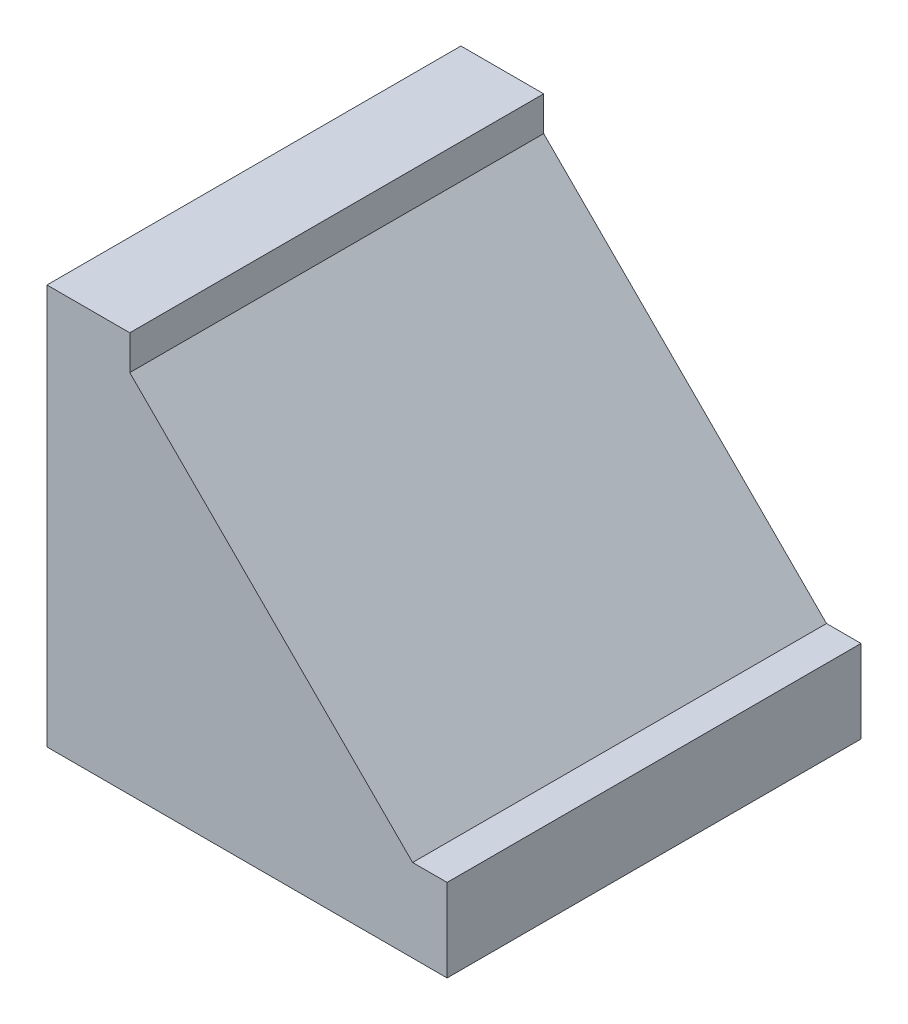
ISO-10303-21;
HEADER;
FILE_DESCRIPTION(('STEP AP214'),'2;1');
FILE_NAME('part.step','',(''),(''),'','','');
FILE_SCHEMA(('AUTOMOTIVE_DESIGN { 1 0 10303 214 1 1 1 1 }'));
ENDSEC;
DATA;
#1=APPLICATION_CONTEXT('core data for automotive mechanical design processes');
#2=APPLICATION_PROTOCOL_DEFINITION('international standard','automotive_design',2000,#1);
#3=PRODUCT_CONTEXT('',#1,'mechanical');
#4=PRODUCT('Part','Part','',(#3));
#5=PRODUCT_RELATED_PRODUCT_CATEGORY('part','',(#4));
#6=PRODUCT_DEFINITION_FORMATION('','',#4);
#7=PRODUCT_DEFINITION_CONTEXT('part definition',#1,'design');
#8=PRODUCT_DEFINITION('design','',#6,#7);
#9=PRODUCT_DEFINITION_SHAPE('','',#8);
#10=(LENGTH_UNIT() NAMED_UNIT(*) SI_UNIT(.MILLI.,.METRE.));
#11=(NAMED_UNIT(*) PLANE_ANGLE_UNIT() SI_UNIT($,.RADIAN.));
#12=(NAMED_UNIT(*) SI_UNIT($,.STERADIAN.) SOLID_ANGLE_UNIT());
#13=UNCERTAINTY_MEASURE_WITH_UNIT(LENGTH_MEASURE(1.E-05),#10,'distance_accuracy_value','');
#14=(GEOMETRIC_REPRESENTATION_CONTEXT(3) GLOBAL_UNCERTAINTY_ASSIGNED_CONTEXT((#13)) GLOBAL_UNIT_ASSIGNED_CONTEXT((#10,
#11,#12)) REPRESENTATION_CONTEXT('',''));
#15=CARTESIAN_POINT('',(0.,0.,0.));
#16=DIRECTION('',(0.,0.,1.));
#17=DIRECTION('',(1.,0.,0.));
#18=AXIS2_PLACEMENT_3D('',#15,#16,#17);
#19=CARTESIAN_POINT('',(12.,58.,60.));
#20=DIRECTION('',(0.,-1.,0.));
#21=DIRECTION('',(1.,0.,0.));
#22=AXIS2_PLACEMENT_3D('',#19,#20,#21);
#23=PLANE('',#22);
#24=DIRECTION('',(-1.,0.,0.));
#25=VECTOR('',#24,1.);
#26=CARTESIAN_POINT('',(12.,58.,0.));
#27=LINE('',#26,#25);
#28=CARTESIAN_POINT('',(12.,58.,0.));
#29=VERTEX_POINT('',#28);
#30=CARTESIAN_POINT('',(0.,58.,0.));
#31=VERTEX_POINT('',#30);
#32=EDGE_CURVE('E126',#29,#31,#27,.T.);
#33=ORIENTED_EDGE('',*,*,#32,.T.);
#34=DIRECTION('',(0.,0.,-1.));
#35=VECTOR('',#34,1.);
#36=CARTESIAN_POINT('',(0.,58.,60.));
#37=LINE('',#36,#35);
#38=CARTESIAN_POINT('',(0.,58.,60.));
#39=VERTEX_POINT('',#38);
#40=EDGE_CURVE('E11',#39,#31,#37,.T.);
#41=ORIENTED_EDGE('',*,*,#40,.F.);
#42=DIRECTION('',(-1.,0.,0.));
#43=VECTOR('',#42,1.);
#44=CARTESIAN_POINT('',(12.,58.,60.));
#45=LINE('',#44,#43);
#46=CARTESIAN_POINT('',(12.,58.,60.));
#47=VERTEX_POINT('',#46);
#48=EDGE_CURVE('E138',#47,#39,#45,.T.);
#49=ORIENTED_EDGE('',*,*,#48,.F.);
#50=DIRECTION('',(0.,0.,-1.));
#51=VECTOR('',#50,1.);
#52=CARTESIAN_POINT('',(12.,58.,60.));
#53=LINE('',#52,#51);
#54=EDGE_CURVE('E122',#47,#29,#53,.T.);
#55=ORIENTED_EDGE('',*,*,#54,.T.);
#56=EDGE_LOOP('',(#33,#41,#49,#55));
#57=FACE_BOUND('',#56,.T.);
#58=ADVANCED_FACE('F36',(#57),#23,.F.);
#59=CARTESIAN_POINT('',(0.,58.,60.));
#60=DIRECTION('',(1.,0.,0.));
#61=DIRECTION('',(0.,1.,0.));
#62=AXIS2_PLACEMENT_3D('',#59,#60,#61);
#63=PLANE('',#62);
#64=DIRECTION('',(0.,-1.,0.));
#65=VECTOR('',#64,1.);
#66=CARTESIAN_POINT('',(0.,58.,0.));
#67=LINE('',#66,#65);
#68=CARTESIAN_POINT('',(0.,0.,0.));
#69=VERTEX_POINT('',#68);
#70=EDGE_CURVE('E129',#31,#69,#67,.T.);
#71=ORIENTED_EDGE('',*,*,#70,.T.);
#72=DIRECTION('',(0.,0.,-1.));
#73=VECTOR('',#72,1.);
#74=CARTESIAN_POINT('',(0.,0.,60.));
#75=LINE('',#74,#73);
#76=CARTESIAN_POINT('',(0.,0.,60.));
#77=VERTEX_POINT('',#76);
#78=EDGE_CURVE('E44',#77,#69,#75,.T.);
#79=ORIENTED_EDGE('',*,*,#78,.F.);
#80=DIRECTION('',(0.,-1.,0.));
#81=VECTOR('',#80,1.);
#82=CARTESIAN_POINT('',(0.,58.,60.));
#83=LINE('',#82,#81);
#84=EDGE_CURVE('E92',#39,#77,#83,.T.);
#85=ORIENTED_EDGE('',*,*,#84,.F.);
#86=ORIENTED_EDGE('',*,*,#40,.T.);
#87=EDGE_LOOP('',(#71,#79,#85,#86));
#88=FACE_BOUND('',#87,.T.);
#89=ADVANCED_FACE('F163',(#88),#63,.F.);
#90=CARTESIAN_POINT('',(0.,0.,60.));
#91=DIRECTION('',(0.,1.,0.));
#92=DIRECTION('',(0.,0.,1.));
#93=AXIS2_PLACEMENT_3D('',#90,#91,#92);
#94=PLANE('',#93);
#95=DIRECTION('',(1.,0.,0.));
#96=VECTOR('',#95,1.);
#97=CARTESIAN_POINT('',(0.,0.,0.));
#98=LINE('',#97,#96);
#99=CARTESIAN_POINT('',(58.,0.,0.));
#100=VERTEX_POINT('',#99);
#101=EDGE_CURVE('E131',#69,#100,#98,.T.);
#102=ORIENTED_EDGE('',*,*,#101,.T.);
#103=DIRECTION('',(0.,0.,-1.));
#104=VECTOR('',#103,1.);
#105=CARTESIAN_POINT('',(58.,0.,60.));
#106=LINE('',#105,#104);
#107=CARTESIAN_POINT('',(58.,0.,60.));
#108=VERTEX_POINT('',#107);
#109=EDGE_CURVE('E142',#108,#100,#106,.T.);
#110=ORIENTED_EDGE('',*,*,#109,.F.);
#111=DIRECTION('',(1.,0.,0.));
#112=VECTOR('',#111,1.);
#113=CARTESIAN_POINT('',(0.,0.,60.));
#114=LINE('',#113,#112);
#115=EDGE_CURVE('E150',#77,#108,#114,.T.);
#116=ORIENTED_EDGE('',*,*,#115,.F.);
#117=ORIENTED_EDGE('',*,*,#78,.T.);
#118=EDGE_LOOP('',(#102,#110,#116,#117));
#119=FACE_BOUND('',#118,.T.);
#120=ADVANCED_FACE('F148',(#119),#94,.F.);
#121=CARTESIAN_POINT('',(58.,0.,60.));
#122=DIRECTION('',(-1.,0.,0.));
#123=DIRECTION('',(0.,-1.,0.));
#124=AXIS2_PLACEMENT_3D('',#121,#122,#123);
#125=PLANE('',#124);
#126=DIRECTION('',(0.,1.,0.));
#127=VECTOR('',#126,1.);
#128=CARTESIAN_POINT('',(58.,0.,0.));
#129=LINE('',#128,#127);
#130=CARTESIAN_POINT('',(58.,12.,0.));
#131=VERTEX_POINT('',#130);
#132=EDGE_CURVE('E133',#100,#131,#129,.T.);
#133=ORIENTED_EDGE('',*,*,#132,.T.);
#134=DIRECTION('',(0.,0.,-1.));
#135=VECTOR('',#134,1.);
#136=CARTESIAN_POINT('',(58.,12.,60.));
#137=LINE('',#136,#135);
#138=CARTESIAN_POINT('',(58.,12.,60.));
#139=VERTEX_POINT('',#138);
#140=EDGE_CURVE('E117',#139,#131,#137,.T.);
#141=ORIENTED_EDGE('',*,*,#140,.F.);
#142=DIRECTION('',(0.,1.,0.));
#143=VECTOR('',#142,1.);
#144=CARTESIAN_POINT('',(58.,0.,60.));
#145=LINE('',#144,#143);
#146=EDGE_CURVE('E108',#108,#139,#145,.T.);
#147=ORIENTED_EDGE('',*,*,#146,.F.);
#148=ORIENTED_EDGE('',*,*,#109,.T.);
#149=EDGE_LOOP('',(#133,#141,#147,#148));
#150=FACE_BOUND('',#149,.T.);
#151=ADVANCED_FACE('F156',(#150),#125,.F.);
#152=CARTESIAN_POINT('',(58.,12.,60.));
#153=DIRECTION('',(0.,-1.,0.));
#154=DIRECTION('',(1.,0.,0.));
#155=AXIS2_PLACEMENT_3D('',#152,#153,#154);
#156=PLANE('',#155);
#157=DIRECTION('',(-1.,0.,0.));
#158=VECTOR('',#157,1.);
#159=CARTESIAN_POINT('',(58.,12.,0.));
#160=LINE('',#159,#158);
#161=CARTESIAN_POINT('',(53.,12.,0.));
#162=VERTEX_POINT('',#161);
#163=EDGE_CURVE('E116',#131,#162,#160,.T.);
#164=ORIENTED_EDGE('',*,*,#163,.T.);
#165=DIRECTION('',(0.,0.,-1.));
#166=VECTOR('',#165,1.);
#167=CARTESIAN_POINT('',(53.,12.,60.));
#168=LINE('',#167,#166);
#169=CARTESIAN_POINT('',(53.,12.,60.));
#170=VERTEX_POINT('',#169);
#171=EDGE_CURVE('E113',#170,#162,#168,.T.);
#172=ORIENTED_EDGE('',*,*,#171,.F.);
#173=DIRECTION('',(-1.,0.,0.));
#174=VECTOR('',#173,1.);
#175=CARTESIAN_POINT('',(58.,12.,60.));
#176=LINE('',#175,#174);
#177=EDGE_CURVE('E102',#139,#170,#176,.T.);
#178=ORIENTED_EDGE('',*,*,#177,.F.);
#179=ORIENTED_EDGE('',*,*,#140,.T.);
#180=EDGE_LOOP('',(#164,#172,#178,#179));
#181=FACE_BOUND('',#180,.T.);
#182=ADVANCED_FACE('F114',(#181),#156,.F.);
#183=CARTESIAN_POINT('',(53.,12.,60.));
#184=DIRECTION('',(-0.707106781186548,-0.707106781186547,0.));
#185=DIRECTION('',(0.707106781186547,-0.707106781186548,0.));
#186=AXIS2_PLACEMENT_3D('',#183,#184,#185);
#187=PLANE('',#186);
#188=DIRECTION('',(-0.707106781186547,0.707106781186548,0.));
#189=VECTOR('',#188,1.);
#190=CARTESIAN_POINT('',(53.,12.,0.));
#191=LINE('',#190,#189);
#192=CARTESIAN_POINT('',(12.,53.,0.));
#193=VERTEX_POINT('',#192);
#194=EDGE_CURVE('E78',#162,#193,#191,.T.);
#195=ORIENTED_EDGE('',*,*,#194,.T.);
#196=DIRECTION('',(0.,0.,-1.));
#197=VECTOR('',#196,1.);
#198=CARTESIAN_POINT('',(12.,53.,60.));
#199=LINE('',#198,#197);
#200=CARTESIAN_POINT('',(12.,53.,60.));
#201=VERTEX_POINT('',#200);
#202=EDGE_CURVE('E118',#201,#193,#199,.T.);
#203=ORIENTED_EDGE('',*,*,#202,.F.);
#204=DIRECTION('',(-0.707106781186547,0.707106781186548,0.));
#205=VECTOR('',#204,1.);
#206=CARTESIAN_POINT('',(53.,12.,60.));
#207=LINE('',#206,#205);
#208=EDGE_CURVE('E106',#170,#201,#207,.T.);
#209=ORIENTED_EDGE('',*,*,#208,.F.);
#210=ORIENTED_EDGE('',*,*,#171,.T.);
#211=EDGE_LOOP('',(#195,#203,#209,#210));
#212=FACE_BOUND('',#211,.T.);
#213=ADVANCED_FACE('F120',(#212),#187,.F.);
#214=CARTESIAN_POINT('',(12.,53.,60.));
#215=DIRECTION('',(-1.,0.,0.));
#216=DIRECTION('',(0.,-1.,0.));
#217=AXIS2_PLACEMENT_3D('',#214,#215,#216);
#218=PLANE('',#217);
#219=DIRECTION('',(0.,1.,0.));
#220=VECTOR('',#219,1.);
#221=CARTESIAN_POINT('',(12.,53.,0.));
#222=LINE('',#221,#220);
#223=EDGE_CURVE('E84',#193,#29,#222,.T.);
#224=ORIENTED_EDGE('',*,*,#223,.T.);
#225=ORIENTED_EDGE('',*,*,#54,.F.);
#226=DIRECTION('',(0.,1.,0.));
#227=VECTOR('',#226,1.);
#228=CARTESIAN_POINT('',(12.,53.,60.));
#229=LINE('',#228,#227);
#230=EDGE_CURVE('E52',#201,#47,#229,.T.);
#231=ORIENTED_EDGE('',*,*,#230,.F.);
#232=ORIENTED_EDGE('',*,*,#202,.T.);
#233=EDGE_LOOP('',(#224,#225,#231,#232));
#234=FACE_BOUND('',#233,.T.);
#235=ADVANCED_FACE('F177',(#234),#218,.F.);
#236=CARTESIAN_POINT('',(0.,0.,60.));
#237=DIRECTION('',(0.,0.,1.));
#238=DIRECTION('',(1.,0.,0.));
#239=AXIS2_PLACEMENT_3D('',#236,#237,#238);
#240=PLANE('',#239);
#241=ORIENTED_EDGE('',*,*,#48,.T.);
#242=ORIENTED_EDGE('',*,*,#84,.T.);
#243=ORIENTED_EDGE('',*,*,#115,.T.);
#244=ORIENTED_EDGE('',*,*,#146,.T.);
#245=ORIENTED_EDGE('',*,*,#177,.T.);
#246=ORIENTED_EDGE('',*,*,#208,.T.);
#247=ORIENTED_EDGE('',*,*,#230,.T.);
#248=EDGE_LOOP('',(#241,#242,#243,#244,#245,#246,#247));
#249=FACE_BOUND('',#248,.T.);
#250=ADVANCED_FACE('F104',(#249),#240,.T.);
#251=CARTESIAN_POINT('',(0.,0.,0.));
#252=DIRECTION('',(0.,0.,1.));
#253=DIRECTION('',(1.,0.,0.));
#254=AXIS2_PLACEMENT_3D('',#251,#252,#253);
#255=PLANE('',#254);
#256=ORIENTED_EDGE('',*,*,#32,.F.);
#257=ORIENTED_EDGE('',*,*,#223,.F.);
#258=ORIENTED_EDGE('',*,*,#194,.F.);
#259=ORIENTED_EDGE('',*,*,#163,.F.);
#260=ORIENTED_EDGE('',*,*,#132,.F.);
#261=ORIENTED_EDGE('',*,*,#101,.F.);
#262=ORIENTED_EDGE('',*,*,#70,.F.);
#263=EDGE_LOOP('',(#256,#257,#258,#259,#260,#261,#262));
#264=FACE_BOUND('',#263,.T.);
#265=ADVANCED_FACE('F154',(#264),#255,.F.);
#266=CLOSED_SHELL('',(#58,#89,#120,#151,#182,#213,#235,#250,#265));
#267=MANIFOLD_SOLID_BREP('B2',#266);
#268=ADVANCED_BREP_SHAPE_REPRESENTATION('',(#18,#267),#14);
#269=SHAPE_DEFINITION_REPRESENTATION(#9,#268);
ENDSEC;
END-ISO-10303-21;
